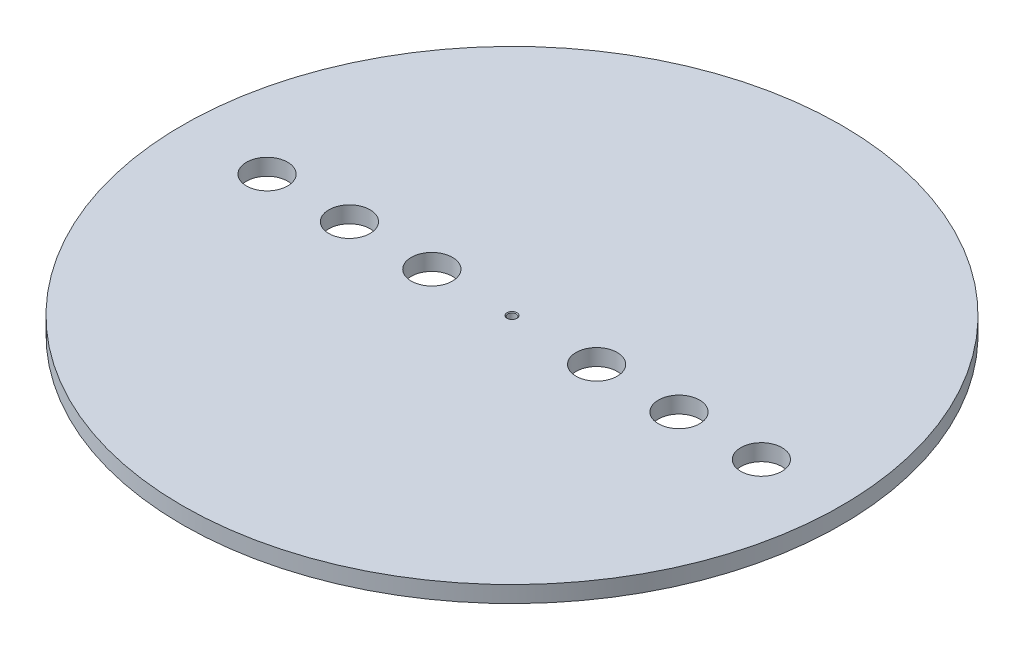
ISO-10303-21;
HEADER;
FILE_DESCRIPTION(('STEP AP214'),'2;1');
FILE_NAME('part.step','',(''),(''),'','','');
FILE_SCHEMA(('AUTOMOTIVE_DESIGN { 1 0 10303 214 1 1 1 1 }'));
ENDSEC;
DATA;
#1=APPLICATION_CONTEXT('core data for automotive mechanical design processes');
#2=APPLICATION_PROTOCOL_DEFINITION('international standard','automotive_design',2000,#1);
#3=PRODUCT_CONTEXT('',#1,'mechanical');
#4=PRODUCT('Part','Part','',(#3));
#5=PRODUCT_RELATED_PRODUCT_CATEGORY('part','',(#4));
#6=PRODUCT_DEFINITION_FORMATION('','',#4);
#7=PRODUCT_DEFINITION_CONTEXT('part definition',#1,'design');
#8=PRODUCT_DEFINITION('design','',#6,#7);
#9=PRODUCT_DEFINITION_SHAPE('','',#8);
#10=(LENGTH_UNIT() NAMED_UNIT(*) SI_UNIT(.MILLI.,.METRE.));
#11=(NAMED_UNIT(*) PLANE_ANGLE_UNIT() SI_UNIT($,.RADIAN.));
#12=(NAMED_UNIT(*) SI_UNIT($,.STERADIAN.) SOLID_ANGLE_UNIT());
#13=UNCERTAINTY_MEASURE_WITH_UNIT(LENGTH_MEASURE(1.E-05),#10,'distance_accuracy_value','');
#14=(GEOMETRIC_REPRESENTATION_CONTEXT(3) GLOBAL_UNCERTAINTY_ASSIGNED_CONTEXT((#13)) GLOBAL_UNIT_ASSIGNED_CONTEXT((#10,
#11,#12)) REPRESENTATION_CONTEXT('',''));
#15=CARTESIAN_POINT('',(0.,0.,0.));
#16=DIRECTION('',(0.,0.,1.));
#17=DIRECTION('',(1.,0.,0.));
#18=AXIS2_PLACEMENT_3D('',#15,#16,#17);
#19=CARTESIAN_POINT('',(0.,20.,0.));
#20=DIRECTION('',(0.,-1.,0.));
#21=DIRECTION('',(0.,0.,-1.));
#22=AXIS2_PLACEMENT_3D('',#19,#20,#21);
#23=CYLINDRICAL_SURFACE('',#22,400.);
#24=CARTESIAN_POINT('',(0.,20.,0.));
#25=DIRECTION('',(0.,1.,0.));
#26=DIRECTION('',(0.,0.,1.));
#27=AXIS2_PLACEMENT_3D('',#24,#25,#26);
#28=CIRCLE('',#27,400.);
#29=CARTESIAN_POINT('',(0.,20.,400.));
#30=VERTEX_POINT('',#29);
#31=EDGE_CURVE('E10',#30,#30,#28,.T.);
#32=ORIENTED_EDGE('',*,*,#31,.F.);
#33=EDGE_LOOP('',(#32));
#34=FACE_BOUND('',#33,.T.);
#35=CARTESIAN_POINT('',(0.,0.,0.));
#36=DIRECTION('',(0.,1.,0.));
#37=DIRECTION('',(0.,0.,1.));
#38=AXIS2_PLACEMENT_3D('',#35,#36,#37);
#39=CIRCLE('',#38,400.);
#40=CARTESIAN_POINT('',(0.,0.,400.));
#41=VERTEX_POINT('',#40);
#42=EDGE_CURVE('E40',#41,#41,#39,.T.);
#43=ORIENTED_EDGE('',*,*,#42,.T.);
#44=EDGE_LOOP('',(#43));
#45=FACE_BOUND('',#44,.T.);
#46=ADVANCED_FACE('F33',(#34,#45),#23,.T.);
#47=CARTESIAN_POINT('',(0.,20.,0.));
#48=DIRECTION('',(0.,1.,0.));
#49=DIRECTION('',(0.,0.,1.));
#50=AXIS2_PLACEMENT_3D('',#47,#48,#49);
#51=PLANE('',#50);
#52=CARTESIAN_POINT('',(0.,20.,0.));
#53=DIRECTION('',(0.,1.,0.));
#54=DIRECTION('',(0.,0.,1.));
#55=AXIS2_PLACEMENT_3D('',#52,#53,#54);
#56=CIRCLE('',#55,6.025);
#57=CARTESIAN_POINT('',(0.,20.,6.025));
#58=VERTEX_POINT('',#57);
#59=EDGE_CURVE('E85',#58,#58,#56,.T.);
#60=ORIENTED_EDGE('',*,*,#59,.F.);
#61=EDGE_LOOP('',(#60));
#62=FACE_BOUND('',#61,.T.);
#63=CARTESIAN_POINT('',(-297.301252253732,20.,2.09488880330588E-12));
#64=DIRECTION('',(0.,1.,0.));
#65=DIRECTION('',(0.,0.,1.));
#66=AXIS2_PLACEMENT_3D('',#63,#64,#65);
#67=CIRCLE('',#66,25.);
#68=CARTESIAN_POINT('',(-297.301252253732,20.,25.0000000000021));
#69=VERTEX_POINT('',#68);
#70=EDGE_CURVE('E56',#69,#69,#67,.T.);
#71=ORIENTED_EDGE('',*,*,#70,.F.);
#72=EDGE_LOOP('',(#71));
#73=FACE_BOUND('',#72,.T.);
#74=CARTESIAN_POINT('',(-197.301252253732,20.,1.39659253553725E-12));
#75=DIRECTION('',(0.,1.,0.));
#76=DIRECTION('',(0.,0.,1.));
#77=AXIS2_PLACEMENT_3D('',#74,#75,#76);
#78=CIRCLE('',#77,25.);
#79=CARTESIAN_POINT('',(-197.301252253732,20.,25.0000000000014));
#80=VERTEX_POINT('',#79);
#81=EDGE_CURVE('E62',#80,#80,#78,.T.);
#82=ORIENTED_EDGE('',*,*,#81,.F.);
#83=EDGE_LOOP('',(#82));
#84=FACE_BOUND('',#83,.T.);
#85=CARTESIAN_POINT('',(-97.301252253732,20.,6.98296267768627E-13));
#86=DIRECTION('',(0.,1.,0.));
#87=DIRECTION('',(0.,0.,1.));
#88=AXIS2_PLACEMENT_3D('',#85,#86,#87);
#89=CIRCLE('',#88,25.);
#90=CARTESIAN_POINT('',(-97.301252253732,20.,25.0000000000007));
#91=VERTEX_POINT('',#90);
#92=EDGE_CURVE('E68',#91,#91,#89,.T.);
#93=ORIENTED_EDGE('',*,*,#92,.F.);
#94=EDGE_LOOP('',(#93));
#95=FACE_BOUND('',#94,.T.);
#96=CARTESIAN_POINT('',(302.698747746268,20.,0.));
#97=DIRECTION('',(0.,1.,0.));
#98=DIRECTION('',(0.,0.,1.));
#99=AXIS2_PLACEMENT_3D('',#96,#97,#98);
#100=CIRCLE('',#99,25.);
#101=CARTESIAN_POINT('',(302.698747746268,20.,25.));
#102=VERTEX_POINT('',#101);
#103=EDGE_CURVE('E74',#102,#102,#100,.T.);
#104=ORIENTED_EDGE('',*,*,#103,.F.);
#105=EDGE_LOOP('',(#104));
#106=FACE_BOUND('',#105,.T.);
#107=CARTESIAN_POINT('',(202.698747746268,20.,0.));
#108=DIRECTION('',(0.,1.,0.));
#109=DIRECTION('',(0.,0.,1.));
#110=AXIS2_PLACEMENT_3D('',#107,#108,#109);
#111=CIRCLE('',#110,25.);
#112=CARTESIAN_POINT('',(202.698747746268,20.,25.));
#113=VERTEX_POINT('',#112);
#114=EDGE_CURVE('E50',#113,#113,#111,.T.);
#115=ORIENTED_EDGE('',*,*,#114,.F.);
#116=EDGE_LOOP('',(#115));
#117=FACE_BOUND('',#116,.T.);
#118=CARTESIAN_POINT('',(102.698747746268,20.,0.));
#119=DIRECTION('',(0.,1.,0.));
#120=DIRECTION('',(0.,0.,1.));
#121=AXIS2_PLACEMENT_3D('',#118,#119,#120);
#122=CIRCLE('',#121,25.);
#123=CARTESIAN_POINT('',(102.698747746268,20.,25.));
#124=VERTEX_POINT('',#123);
#125=EDGE_CURVE('E45',#124,#124,#122,.T.);
#126=ORIENTED_EDGE('',*,*,#125,.F.);
#127=EDGE_LOOP('',(#126));
#128=FACE_BOUND('',#127,.T.);
#129=ORIENTED_EDGE('',*,*,#31,.T.);
#130=EDGE_LOOP('',(#129));
#131=FACE_BOUND('',#130,.T.);
#132=ADVANCED_FACE('F91',(#62,#73,#84,#95,#106,#117,#128,#131),#51,.T.);
#133=CARTESIAN_POINT('',(0.,0.,0.));
#134=DIRECTION('',(0.,1.,0.));
#135=DIRECTION('',(0.,0.,1.));
#136=AXIS2_PLACEMENT_3D('',#133,#134,#135);
#137=PLANE('',#136);
#138=CARTESIAN_POINT('',(0.,0.,0.));
#139=DIRECTION('',(0.,1.,0.));
#140=DIRECTION('',(0.,0.,1.));
#141=AXIS2_PLACEMENT_3D('',#138,#139,#140);
#142=CIRCLE('',#141,5.1);
#143=CARTESIAN_POINT('',(0.,0.,5.1));
#144=VERTEX_POINT('',#143);
#145=EDGE_CURVE('E36',#144,#144,#142,.T.);
#146=ORIENTED_EDGE('',*,*,#145,.T.);
#147=EDGE_LOOP('',(#146));
#148=FACE_BOUND('',#147,.T.);
#149=CARTESIAN_POINT('',(-297.301252253732,0.,2.09488880330588E-12));
#150=DIRECTION('',(0.,1.,0.));
#151=DIRECTION('',(0.,0.,1.));
#152=AXIS2_PLACEMENT_3D('',#149,#150,#151);
#153=CIRCLE('',#152,25.);
#154=CARTESIAN_POINT('',(-297.301252253732,0.,25.0000000000021));
#155=VERTEX_POINT('',#154);
#156=EDGE_CURVE('E53',#155,#155,#153,.T.);
#157=ORIENTED_EDGE('',*,*,#156,.T.);
#158=EDGE_LOOP('',(#157));
#159=FACE_BOUND('',#158,.T.);
#160=CARTESIAN_POINT('',(-197.301252253732,0.,1.39659253553725E-12));
#161=DIRECTION('',(0.,1.,0.));
#162=DIRECTION('',(0.,0.,1.));
#163=AXIS2_PLACEMENT_3D('',#160,#161,#162);
#164=CIRCLE('',#163,25.);
#165=CARTESIAN_POINT('',(-197.301252253732,0.,25.0000000000014));
#166=VERTEX_POINT('',#165);
#167=EDGE_CURVE('E59',#166,#166,#164,.T.);
#168=ORIENTED_EDGE('',*,*,#167,.T.);
#169=EDGE_LOOP('',(#168));
#170=FACE_BOUND('',#169,.T.);
#171=CARTESIAN_POINT('',(-97.301252253732,0.,6.98296267768627E-13));
#172=DIRECTION('',(0.,1.,0.));
#173=DIRECTION('',(0.,0.,1.));
#174=AXIS2_PLACEMENT_3D('',#171,#172,#173);
#175=CIRCLE('',#174,25.);
#176=CARTESIAN_POINT('',(-97.301252253732,0.,25.0000000000007));
#177=VERTEX_POINT('',#176);
#178=EDGE_CURVE('E65',#177,#177,#175,.T.);
#179=ORIENTED_EDGE('',*,*,#178,.T.);
#180=EDGE_LOOP('',(#179));
#181=FACE_BOUND('',#180,.T.);
#182=CARTESIAN_POINT('',(302.698747746268,0.,0.));
#183=DIRECTION('',(0.,1.,0.));
#184=DIRECTION('',(0.,0.,1.));
#185=AXIS2_PLACEMENT_3D('',#182,#183,#184);
#186=CIRCLE('',#185,25.);
#187=CARTESIAN_POINT('',(302.698747746268,0.,25.));
#188=VERTEX_POINT('',#187);
#189=EDGE_CURVE('E71',#188,#188,#186,.T.);
#190=ORIENTED_EDGE('',*,*,#189,.T.);
#191=EDGE_LOOP('',(#190));
#192=FACE_BOUND('',#191,.T.);
#193=CARTESIAN_POINT('',(202.698747746268,0.,0.));
#194=DIRECTION('',(0.,1.,0.));
#195=DIRECTION('',(0.,0.,1.));
#196=AXIS2_PLACEMENT_3D('',#193,#194,#195);
#197=CIRCLE('',#196,25.);
#198=CARTESIAN_POINT('',(202.698747746268,0.,25.));
#199=VERTEX_POINT('',#198);
#200=EDGE_CURVE('E77',#199,#199,#197,.T.);
#201=ORIENTED_EDGE('',*,*,#200,.T.);
#202=EDGE_LOOP('',(#201));
#203=FACE_BOUND('',#202,.T.);
#204=CARTESIAN_POINT('',(102.698747746268,0.,0.));
#205=DIRECTION('',(0.,1.,0.));
#206=DIRECTION('',(0.,0.,1.));
#207=AXIS2_PLACEMENT_3D('',#204,#205,#206);
#208=CIRCLE('',#207,25.);
#209=CARTESIAN_POINT('',(102.698747746268,0.,25.));
#210=VERTEX_POINT('',#209);
#211=EDGE_CURVE('E47',#210,#210,#208,.T.);
#212=ORIENTED_EDGE('',*,*,#211,.T.);
#213=EDGE_LOOP('',(#212));
#214=FACE_BOUND('',#213,.T.);
#215=ORIENTED_EDGE('',*,*,#42,.F.);
#216=EDGE_LOOP('',(#215));
#217=FACE_BOUND('',#216,.T.);
#218=ADVANCED_FACE('F94',(#148,#159,#170,#181,#192,#203,#214,#217),#137,.F.);
#219=CARTESIAN_POINT('',(102.698747746268,20.,0.));
#220=DIRECTION('',(0.,-1.,0.));
#221=DIRECTION('',(0.,0.,-1.));
#222=AXIS2_PLACEMENT_3D('',#219,#220,#221);
#223=CYLINDRICAL_SURFACE('',#222,25.);
#224=ORIENTED_EDGE('',*,*,#125,.T.);
#225=EDGE_LOOP('',(#224));
#226=FACE_BOUND('',#225,.T.);
#227=ORIENTED_EDGE('',*,*,#211,.F.);
#228=EDGE_LOOP('',(#227));
#229=FACE_BOUND('',#228,.T.);
#230=ADVANCED_FACE('F108',(#226,#229),#223,.F.);
#231=CARTESIAN_POINT('',(202.698747746268,20.,0.));
#232=DIRECTION('',(0.,-1.,0.));
#233=DIRECTION('',(0.,0.,-1.));
#234=AXIS2_PLACEMENT_3D('',#231,#232,#233);
#235=CYLINDRICAL_SURFACE('',#234,25.);
#236=ORIENTED_EDGE('',*,*,#114,.T.);
#237=EDGE_LOOP('',(#236));
#238=FACE_BOUND('',#237,.T.);
#239=ORIENTED_EDGE('',*,*,#200,.F.);
#240=EDGE_LOOP('',(#239));
#241=FACE_BOUND('',#240,.T.);
#242=ADVANCED_FACE('F111',(#238,#241),#235,.F.);
#243=CARTESIAN_POINT('',(302.698747746268,20.,0.));
#244=DIRECTION('',(0.,-1.,0.));
#245=DIRECTION('',(0.,0.,-1.));
#246=AXIS2_PLACEMENT_3D('',#243,#244,#245);
#247=CYLINDRICAL_SURFACE('',#246,25.);
#248=ORIENTED_EDGE('',*,*,#103,.T.);
#249=EDGE_LOOP('',(#248));
#250=FACE_BOUND('',#249,.T.);
#251=ORIENTED_EDGE('',*,*,#189,.F.);
#252=EDGE_LOOP('',(#251));
#253=FACE_BOUND('',#252,.T.);
#254=ADVANCED_FACE('F144',(#250,#253),#247,.F.);
#255=CARTESIAN_POINT('',(-97.301252253732,20.,6.98296267768627E-13));
#256=DIRECTION('',(0.,-1.,0.));
#257=DIRECTION('',(0.,0.,-1.));
#258=AXIS2_PLACEMENT_3D('',#255,#256,#257);
#259=CYLINDRICAL_SURFACE('',#258,25.);
#260=ORIENTED_EDGE('',*,*,#92,.T.);
#261=EDGE_LOOP('',(#260));
#262=FACE_BOUND('',#261,.T.);
#263=ORIENTED_EDGE('',*,*,#178,.F.);
#264=EDGE_LOOP('',(#263));
#265=FACE_BOUND('',#264,.T.);
#266=ADVANCED_FACE('F152',(#262,#265),#259,.F.);
#267=CARTESIAN_POINT('',(-197.301252253732,20.,1.39659253553725E-12));
#268=DIRECTION('',(0.,-1.,0.));
#269=DIRECTION('',(0.,0.,-1.));
#270=AXIS2_PLACEMENT_3D('',#267,#268,#269);
#271=CYLINDRICAL_SURFACE('',#270,25.);
#272=ORIENTED_EDGE('',*,*,#81,.T.);
#273=EDGE_LOOP('',(#272));
#274=FACE_BOUND('',#273,.T.);
#275=ORIENTED_EDGE('',*,*,#167,.F.);
#276=EDGE_LOOP('',(#275));
#277=FACE_BOUND('',#276,.T.);
#278=ADVANCED_FACE('F160',(#274,#277),#271,.F.);
#279=CARTESIAN_POINT('',(-297.301252253732,20.,2.09488880330588E-12));
#280=DIRECTION('',(0.,-1.,0.));
#281=DIRECTION('',(0.,0.,-1.));
#282=AXIS2_PLACEMENT_3D('',#279,#280,#281);
#283=CYLINDRICAL_SURFACE('',#282,25.);
#284=ORIENTED_EDGE('',*,*,#70,.T.);
#285=EDGE_LOOP('',(#284));
#286=FACE_BOUND('',#285,.T.);
#287=ORIENTED_EDGE('',*,*,#156,.F.);
#288=EDGE_LOOP('',(#287));
#289=FACE_BOUND('',#288,.T.);
#290=ADVANCED_FACE('F168',(#286,#289),#283,.F.);
#291=CARTESIAN_POINT('',(0.,20.,0.));
#292=DIRECTION('',(0.,1.,0.));
#293=DIRECTION('',(0.,0.,1.));
#294=AXIS2_PLACEMENT_3D('',#291,#292,#293);
#295=CYLINDRICAL_SURFACE('',#294,5.1);
#296=CARTESIAN_POINT('',(0.,19.075,0.));
#297=DIRECTION('',(0.,1.,0.));
#298=DIRECTION('',(0.,0.,1.));
#299=AXIS2_PLACEMENT_3D('',#296,#297,#298);
#300=CIRCLE('',#299,5.1);
#301=CARTESIAN_POINT('',(0.,19.075,5.1));
#302=VERTEX_POINT('',#301);
#303=EDGE_CURVE('E82',#302,#302,#300,.T.);
#304=ORIENTED_EDGE('',*,*,#303,.T.);
#305=EDGE_LOOP('',(#304));
#306=FACE_BOUND('',#305,.T.);
#307=ORIENTED_EDGE('',*,*,#145,.F.);
#308=EDGE_LOOP('',(#307));
#309=FACE_BOUND('',#308,.T.);
#310=ADVANCED_FACE('F175',(#306,#309),#295,.F.);
#311=CARTESIAN_POINT('',(0.,20.,0.));
#312=DIRECTION('',(0.,1.,0.));
#313=DIRECTION('',(0.,0.,1.));
#314=AXIS2_PLACEMENT_3D('',#311,#312,#313);
#315=CONICAL_SURFACE('',#314,6.025,0.785398163397448);
#316=ORIENTED_EDGE('',*,*,#303,.F.);
#317=EDGE_LOOP('',(#316));
#318=FACE_BOUND('',#317,.T.);
#319=ORIENTED_EDGE('',*,*,#59,.T.);
#320=EDGE_LOOP('',(#319));
#321=FACE_BOUND('',#320,.T.);
#322=ADVANCED_FACE('F89',(#318,#321),#315,.F.);
#323=CLOSED_SHELL('',(#46,#132,#218,#230,#242,#254,#266,#278,#290,#310,#322));
#324=MANIFOLD_SOLID_BREP('B2',#323);
#325=ADVANCED_BREP_SHAPE_REPRESENTATION('',(#18,#324),#14);
#326=SHAPE_DEFINITION_REPRESENTATION(#9,#325);
ENDSEC;
END-ISO-10303-21;
